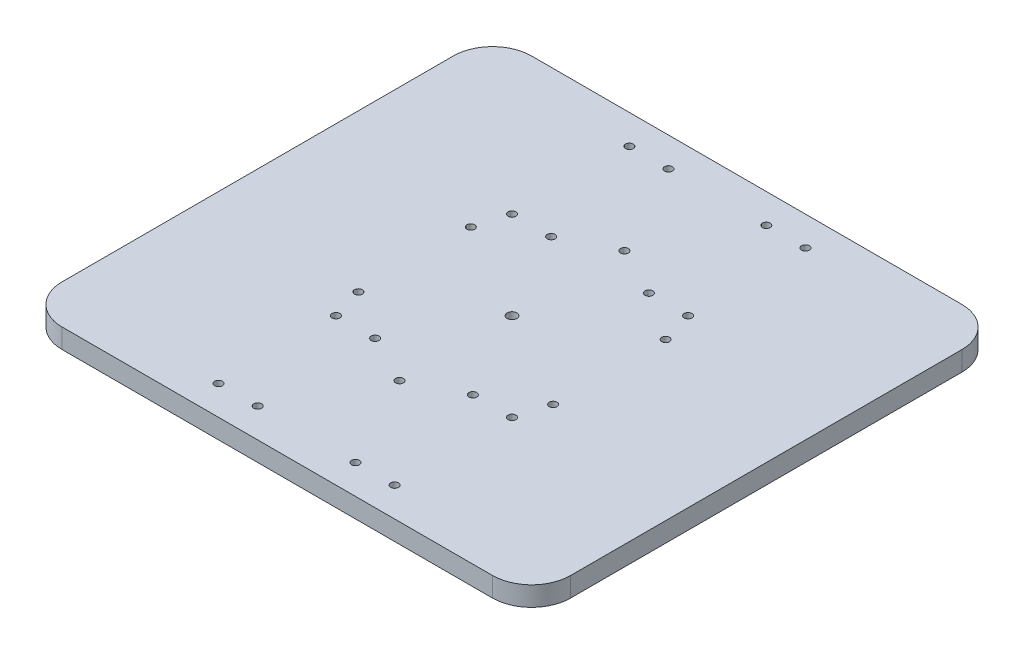
ISO-10303-21;
HEADER;
FILE_DESCRIPTION(('STEP AP214'),'2;1');
FILE_NAME('part.step','',(''),(''),'','','');
FILE_SCHEMA(('AUTOMOTIVE_DESIGN { 1 0 10303 214 1 1 1 1 }'));
ENDSEC;
DATA;
#1=APPLICATION_CONTEXT('core data for automotive mechanical design processes');
#2=APPLICATION_PROTOCOL_DEFINITION('international standard','automotive_design',2000,#1);
#3=PRODUCT_CONTEXT('',#1,'mechanical');
#4=PRODUCT('Part','Part','',(#3));
#5=PRODUCT_RELATED_PRODUCT_CATEGORY('part','',(#4));
#6=PRODUCT_DEFINITION_FORMATION('','',#4);
#7=PRODUCT_DEFINITION_CONTEXT('part definition',#1,'design');
#8=PRODUCT_DEFINITION('design','',#6,#7);
#9=PRODUCT_DEFINITION_SHAPE('','',#8);
#10=(LENGTH_UNIT() NAMED_UNIT(*) SI_UNIT(.MILLI.,.METRE.));
#11=(NAMED_UNIT(*) PLANE_ANGLE_UNIT() SI_UNIT($,.RADIAN.));
#12=(NAMED_UNIT(*) SI_UNIT($,.STERADIAN.) SOLID_ANGLE_UNIT());
#13=UNCERTAINTY_MEASURE_WITH_UNIT(LENGTH_MEASURE(1.E-05),#10,'distance_accuracy_value','');
#14=(GEOMETRIC_REPRESENTATION_CONTEXT(3) GLOBAL_UNCERTAINTY_ASSIGNED_CONTEXT((#13)) GLOBAL_UNIT_ASSIGNED_CONTEXT((#10,
#11,#12)) REPRESENTATION_CONTEXT('',''));
#15=CARTESIAN_POINT('',(0.,0.,0.));
#16=DIRECTION('',(0.,0.,1.));
#17=DIRECTION('',(1.,0.,0.));
#18=AXIS2_PLACEMENT_3D('',#15,#16,#17);
#19=CARTESIAN_POINT('',(130.,10.,120.));
#20=DIRECTION('',(-1.,0.,0.));
#21=DIRECTION('',(0.,0.,1.));
#22=AXIS2_PLACEMENT_3D('',#19,#20,#21);
#23=PLANE('',#22);
#24=DIRECTION('',(0.,0.,-1.));
#25=VECTOR('',#24,1.);
#26=CARTESIAN_POINT('',(130.,0.,120.));
#27=LINE('',#26,#25);
#28=CARTESIAN_POINT('',(130.,0.,100.));
#29=VERTEX_POINT('',#28);
#30=CARTESIAN_POINT('',(130.,0.,-100.));
#31=VERTEX_POINT('',#30);
#32=EDGE_CURVE('E125',#29,#31,#27,.T.);
#33=ORIENTED_EDGE('',*,*,#32,.T.);
#34=DIRECTION('',(0.,-1.,0.));
#35=VECTOR('',#34,1.);
#36=CARTESIAN_POINT('',(130.,10.,-100.));
#37=LINE('',#36,#35);
#38=CARTESIAN_POINT('',(130.,10.,-100.));
#39=VERTEX_POINT('',#38);
#40=EDGE_CURVE('E103',#31,#39,#37,.F.);
#41=ORIENTED_EDGE('',*,*,#40,.T.);
#42=DIRECTION('',(0.,0.,-1.));
#43=VECTOR('',#42,1.);
#44=CARTESIAN_POINT('',(130.,10.,120.));
#45=LINE('',#44,#43);
#46=CARTESIAN_POINT('',(130.,10.,100.));
#47=VERTEX_POINT('',#46);
#48=EDGE_CURVE('E135',#47,#39,#45,.T.);
#49=ORIENTED_EDGE('',*,*,#48,.F.);
#50=DIRECTION('',(0.,-1.,0.));
#51=VECTOR('',#50,1.);
#52=CARTESIAN_POINT('',(130.,10.,100.));
#53=LINE('',#52,#51);
#54=EDGE_CURVE('E108',#47,#29,#53,.T.);
#55=ORIENTED_EDGE('',*,*,#54,.T.);
#56=EDGE_LOOP('',(#33,#41,#49,#55));
#57=FACE_BOUND('',#56,.T.);
#58=ADVANCED_FACE('F32',(#57),#23,.F.);
#59=CARTESIAN_POINT('',(-130.,10.,-120.));
#60=DIRECTION('',(0.,0.,1.));
#61=DIRECTION('',(1.,0.,0.));
#62=AXIS2_PLACEMENT_3D('',#59,#60,#61);
#63=PLANE('',#62);
#64=DIRECTION('',(-1.,0.,0.));
#65=VECTOR('',#64,1.);
#66=CARTESIAN_POINT('',(-130.,10.,-120.));
#67=LINE('',#66,#65);
#68=CARTESIAN_POINT('',(110.,10.,-120.));
#69=VERTEX_POINT('',#68);
#70=CARTESIAN_POINT('',(-110.,10.,-120.));
#71=VERTEX_POINT('',#70);
#72=EDGE_CURVE('E118',#69,#71,#67,.T.);
#73=ORIENTED_EDGE('',*,*,#72,.F.);
#74=DIRECTION('',(0.,-1.,0.));
#75=VECTOR('',#74,1.);
#76=CARTESIAN_POINT('',(110.,10.,-120.));
#77=LINE('',#76,#75);
#78=CARTESIAN_POINT('',(110.,0.,-120.));
#79=VERTEX_POINT('',#78);
#80=EDGE_CURVE('E102',#69,#79,#77,.T.);
#81=ORIENTED_EDGE('',*,*,#80,.T.);
#82=DIRECTION('',(-1.,0.,0.));
#83=VECTOR('',#82,1.);
#84=CARTESIAN_POINT('',(-130.,0.,-120.));
#85=LINE('',#84,#83);
#86=CARTESIAN_POINT('',(-110.,0.,-120.));
#87=VERTEX_POINT('',#86);
#88=EDGE_CURVE('E115',#79,#87,#85,.T.);
#89=ORIENTED_EDGE('',*,*,#88,.T.);
#90=DIRECTION('',(0.,-1.,0.));
#91=VECTOR('',#90,1.);
#92=CARTESIAN_POINT('',(-110.,10.,-120.));
#93=LINE('',#92,#91);
#94=EDGE_CURVE('E120',#87,#71,#93,.F.);
#95=ORIENTED_EDGE('',*,*,#94,.T.);
#96=EDGE_LOOP('',(#73,#81,#89,#95));
#97=FACE_BOUND('',#96,.T.);
#98=ADVANCED_FACE('F114',(#97),#63,.F.);
#99=CARTESIAN_POINT('',(-130.,10.,120.));
#100=DIRECTION('',(1.,0.,0.));
#101=DIRECTION('',(0.,0.,-1.));
#102=AXIS2_PLACEMENT_3D('',#99,#100,#101);
#103=PLANE('',#102);
#104=DIRECTION('',(0.,0.,1.));
#105=VECTOR('',#104,1.);
#106=CARTESIAN_POINT('',(-130.,0.,120.));
#107=LINE('',#106,#105);
#108=CARTESIAN_POINT('',(-130.,0.,-100.));
#109=VERTEX_POINT('',#108);
#110=CARTESIAN_POINT('',(-130.,0.,100.));
#111=VERTEX_POINT('',#110);
#112=EDGE_CURVE('E124',#109,#111,#107,.T.);
#113=ORIENTED_EDGE('',*,*,#112,.T.);
#114=DIRECTION('',(0.,-1.,0.));
#115=VECTOR('',#114,1.);
#116=CARTESIAN_POINT('',(-130.,10.,100.));
#117=LINE('',#116,#115);
#118=CARTESIAN_POINT('',(-130.,10.,100.));
#119=VERTEX_POINT('',#118);
#120=EDGE_CURVE('E11',#111,#119,#117,.F.);
#121=ORIENTED_EDGE('',*,*,#120,.T.);
#122=DIRECTION('',(0.,0.,1.));
#123=VECTOR('',#122,1.);
#124=CARTESIAN_POINT('',(-130.,10.,120.));
#125=LINE('',#124,#123);
#126=CARTESIAN_POINT('',(-130.,10.,-100.));
#127=VERTEX_POINT('',#126);
#128=EDGE_CURVE('E161',#127,#119,#125,.T.);
#129=ORIENTED_EDGE('',*,*,#128,.F.);
#130=DIRECTION('',(0.,-1.,0.));
#131=VECTOR('',#130,1.);
#132=CARTESIAN_POINT('',(-130.,10.,-100.));
#133=LINE('',#132,#131);
#134=EDGE_CURVE('E40',#127,#109,#133,.T.);
#135=ORIENTED_EDGE('',*,*,#134,.T.);
#136=EDGE_LOOP('',(#113,#121,#129,#135));
#137=FACE_BOUND('',#136,.T.);
#138=ADVANCED_FACE('F159',(#137),#103,.F.);
#139=CARTESIAN_POINT('',(-130.,10.,120.));
#140=DIRECTION('',(0.,0.,-1.));
#141=DIRECTION('',(-1.,0.,0.));
#142=AXIS2_PLACEMENT_3D('',#139,#140,#141);
#143=PLANE('',#142);
#144=DIRECTION('',(1.,0.,0.));
#145=VECTOR('',#144,1.);
#146=CARTESIAN_POINT('',(-130.,0.,120.));
#147=LINE('',#146,#145);
#148=CARTESIAN_POINT('',(-110.,0.,120.));
#149=VERTEX_POINT('',#148);
#150=CARTESIAN_POINT('',(110.,0.,120.));
#151=VERTEX_POINT('',#150);
#152=EDGE_CURVE('E128',#149,#151,#147,.T.);
#153=ORIENTED_EDGE('',*,*,#152,.T.);
#154=DIRECTION('',(0.,-1.,0.));
#155=VECTOR('',#154,1.);
#156=CARTESIAN_POINT('',(110.,10.,120.));
#157=LINE('',#156,#155);
#158=CARTESIAN_POINT('',(110.,10.,120.));
#159=VERTEX_POINT('',#158);
#160=EDGE_CURVE('E47',#151,#159,#157,.F.);
#161=ORIENTED_EDGE('',*,*,#160,.T.);
#162=DIRECTION('',(1.,0.,0.));
#163=VECTOR('',#162,1.);
#164=CARTESIAN_POINT('',(-130.,10.,120.));
#165=LINE('',#164,#163);
#166=CARTESIAN_POINT('',(-110.,10.,120.));
#167=VERTEX_POINT('',#166);
#168=EDGE_CURVE('E136',#167,#159,#165,.T.);
#169=ORIENTED_EDGE('',*,*,#168,.F.);
#170=DIRECTION('',(0.,-1.,0.));
#171=VECTOR('',#170,1.);
#172=CARTESIAN_POINT('',(-110.,10.,120.));
#173=LINE('',#172,#171);
#174=EDGE_CURVE('E152',#167,#149,#173,.T.);
#175=ORIENTED_EDGE('',*,*,#174,.T.);
#176=EDGE_LOOP('',(#153,#161,#169,#175));
#177=FACE_BOUND('',#176,.T.);
#178=ADVANCED_FACE('F168',(#177),#143,.F.);
#179=CARTESIAN_POINT('',(0.,10.,0.));
#180=DIRECTION('',(0.,-1.,0.));
#181=DIRECTION('',(0.,0.,-1.));
#182=AXIS2_PLACEMENT_3D('',#179,#180,#181);
#183=PLANE('',#182);
#184=CARTESIAN_POINT('',(-25.,10.,45.));
#185=DIRECTION('',(0.,1.,0.));
#186=DIRECTION('',(0.,0.,1.));
#187=AXIS2_PLACEMENT_3D('',#184,#185,#186);
#188=CIRCLE('',#187,2.);
#189=CARTESIAN_POINT('',(-25.,10.,47.));
#190=VERTEX_POINT('',#189);
#191=EDGE_CURVE('E259',#190,#190,#188,.T.);
#192=ORIENTED_EDGE('',*,*,#191,.F.);
#193=EDGE_LOOP('',(#192));
#194=FACE_BOUND('',#193,.T.);
#195=CARTESIAN_POINT('',(-45.,10.,45.));
#196=DIRECTION('',(0.,1.,0.));
#197=DIRECTION('',(0.,0.,1.));
#198=AXIS2_PLACEMENT_3D('',#195,#196,#197);
#199=CIRCLE('',#198,2.);
#200=CARTESIAN_POINT('',(-45.,10.,47.));
#201=VERTEX_POINT('',#200);
#202=EDGE_CURVE('E272',#201,#201,#199,.T.);
#203=ORIENTED_EDGE('',*,*,#202,.F.);
#204=EDGE_LOOP('',(#203));
#205=FACE_BOUND('',#204,.T.);
#206=CARTESIAN_POINT('',(25.,10.,-45.));
#207=DIRECTION('',(0.,1.,0.));
#208=DIRECTION('',(0.,0.,1.));
#209=AXIS2_PLACEMENT_3D('',#206,#207,#208);
#210=CIRCLE('',#209,2.00000000000001);
#211=CARTESIAN_POINT('',(25.,10.,-43.));
#212=VERTEX_POINT('',#211);
#213=EDGE_CURVE('E265',#212,#212,#210,.T.);
#214=ORIENTED_EDGE('',*,*,#213,.F.);
#215=EDGE_LOOP('',(#214));
#216=FACE_BOUND('',#215,.T.);
#217=CARTESIAN_POINT('',(25.,10.,45.));
#218=DIRECTION('',(0.,1.,0.));
#219=DIRECTION('',(0.,0.,1.));
#220=AXIS2_PLACEMENT_3D('',#217,#218,#219);
#221=CIRCLE('',#220,2.00000000000001);
#222=CARTESIAN_POINT('',(25.,10.,47.));
#223=VERTEX_POINT('',#222);
#224=EDGE_CURVE('E247',#223,#223,#221,.T.);
#225=ORIENTED_EDGE('',*,*,#224,.F.);
#226=EDGE_LOOP('',(#225));
#227=FACE_BOUND('',#226,.T.);
#228=CARTESIAN_POINT('',(45.,10.,45.));
#229=DIRECTION('',(0.,1.,0.));
#230=DIRECTION('',(0.,0.,1.));
#231=AXIS2_PLACEMENT_3D('',#228,#229,#230);
#232=CIRCLE('',#231,2.);
#233=CARTESIAN_POINT('',(45.,10.,47.));
#234=VERTEX_POINT('',#233);
#235=EDGE_CURVE('E254',#234,#234,#232,.T.);
#236=ORIENTED_EDGE('',*,*,#235,.F.);
#237=EDGE_LOOP('',(#236));
#238=FACE_BOUND('',#237,.T.);
#239=CARTESIAN_POINT('',(-25.,10.,105.));
#240=DIRECTION('',(0.,1.,0.));
#241=DIRECTION('',(0.,0.,1.));
#242=AXIS2_PLACEMENT_3D('',#239,#240,#241);
#243=CIRCLE('',#242,2.00000000000001);
#244=CARTESIAN_POINT('',(-25.,10.,107.));
#245=VERTEX_POINT('',#244);
#246=EDGE_CURVE('E295',#245,#245,#243,.T.);
#247=ORIENTED_EDGE('',*,*,#246,.F.);
#248=EDGE_LOOP('',(#247));
#249=FACE_BOUND('',#248,.T.);
#250=CARTESIAN_POINT('',(25.,10.,105.));
#251=DIRECTION('',(0.,1.,0.));
#252=DIRECTION('',(0.,0.,1.));
#253=AXIS2_PLACEMENT_3D('',#250,#251,#252);
#254=CIRCLE('',#253,2.);
#255=CARTESIAN_POINT('',(25.,10.,107.));
#256=VERTEX_POINT('',#255);
#257=EDGE_CURVE('E307',#256,#256,#254,.T.);
#258=ORIENTED_EDGE('',*,*,#257,.F.);
#259=EDGE_LOOP('',(#258));
#260=FACE_BOUND('',#259,.T.);
#261=CARTESIAN_POINT('',(-49.796460717604,10.,-28.7499999999978));
#262=DIRECTION('',(0.,1.,0.));
#263=DIRECTION('',(0.,0.,1.));
#264=AXIS2_PLACEMENT_3D('',#261,#262,#263);
#265=CIRCLE('',#264,2.00000000000247);
#266=CARTESIAN_POINT('',(-49.796460717604,10.,-26.7499999999954));
#267=VERTEX_POINT('',#266);
#268=EDGE_CURVE('E301',#267,#267,#265,.T.);
#269=ORIENTED_EDGE('',*,*,#268,.F.);
#270=EDGE_LOOP('',(#269));
#271=FACE_BOUND('',#270,.T.);
#272=CARTESIAN_POINT('',(-45.,10.,105.));
#273=DIRECTION('',(0.,1.,0.));
#274=DIRECTION('',(0.,0.,1.));
#275=AXIS2_PLACEMENT_3D('',#272,#273,#274);
#276=CIRCLE('',#275,2.);
#277=CARTESIAN_POINT('',(-45.,10.,107.));
#278=VERTEX_POINT('',#277);
#279=EDGE_CURVE('E277',#278,#278,#276,.T.);
#280=ORIENTED_EDGE('',*,*,#279,.F.);
#281=EDGE_LOOP('',(#280));
#282=FACE_BOUND('',#281,.T.);
#283=CARTESIAN_POINT('',(-49.7964607176015,10.,28.7500000000021));
#284=DIRECTION('',(0.,1.,0.));
#285=DIRECTION('',(0.,0.,1.));
#286=AXIS2_PLACEMENT_3D('',#283,#284,#285);
#287=CIRCLE('',#286,2.00000000000465);
#288=CARTESIAN_POINT('',(-49.7964607176015,10.,30.7500000000068));
#289=VERTEX_POINT('',#288);
#290=EDGE_CURVE('E284',#289,#289,#287,.T.);
#291=ORIENTED_EDGE('',*,*,#290,.F.);
#292=EDGE_LOOP('',(#291));
#293=FACE_BOUND('',#292,.T.);
#294=CARTESIAN_POINT('',(-25.,10.,-45.));
#295=DIRECTION('',(0.,1.,0.));
#296=DIRECTION('',(0.,0.,1.));
#297=AXIS2_PLACEMENT_3D('',#294,#295,#296);
#298=CIRCLE('',#297,2.);
#299=CARTESIAN_POINT('',(-25.,10.,-43.));
#300=VERTEX_POINT('',#299);
#301=EDGE_CURVE('E290',#300,#300,#298,.T.);
#302=ORIENTED_EDGE('',*,*,#301,.F.);
#303=EDGE_LOOP('',(#302));
#304=FACE_BOUND('',#303,.T.);
#305=CARTESIAN_POINT('',(-45.,10.,-105.));
#306=DIRECTION('',(0.,1.,0.));
#307=DIRECTION('',(0.,0.,1.));
#308=AXIS2_PLACEMENT_3D('',#305,#306,#307);
#309=CIRCLE('',#308,2.);
#310=CARTESIAN_POINT('',(-45.,10.,-103.));
#311=VERTEX_POINT('',#310);
#312=EDGE_CURVE('E193',#311,#311,#309,.T.);
#313=ORIENTED_EDGE('',*,*,#312,.F.);
#314=EDGE_LOOP('',(#313));
#315=FACE_BOUND('',#314,.T.);
#316=CARTESIAN_POINT('',(45.,10.,-105.));
#317=DIRECTION('',(0.,1.,0.));
#318=DIRECTION('',(0.,0.,1.));
#319=AXIS2_PLACEMENT_3D('',#316,#317,#318);
#320=CIRCLE('',#319,2.);
#321=CARTESIAN_POINT('',(45.,10.,-103.));
#322=VERTEX_POINT('',#321);
#323=EDGE_CURVE('E200',#322,#322,#320,.T.);
#324=ORIENTED_EDGE('',*,*,#323,.F.);
#325=EDGE_LOOP('',(#324));
#326=FACE_BOUND('',#325,.T.);
#327=CARTESIAN_POINT('',(-45.,10.,-45.));
#328=DIRECTION('',(0.,1.,0.));
#329=DIRECTION('',(0.,0.,1.));
#330=AXIS2_PLACEMENT_3D('',#327,#328,#329);
#331=CIRCLE('',#330,2.);
#332=CARTESIAN_POINT('',(-45.,10.,-43.));
#333=VERTEX_POINT('',#332);
#334=EDGE_CURVE('E206',#333,#333,#331,.T.);
#335=ORIENTED_EDGE('',*,*,#334,.F.);
#336=EDGE_LOOP('',(#335));
#337=FACE_BOUND('',#336,.T.);
#338=CARTESIAN_POINT('',(45.,10.,-45.));
#339=DIRECTION('',(0.,1.,0.));
#340=DIRECTION('',(0.,0.,1.));
#341=AXIS2_PLACEMENT_3D('',#338,#339,#340);
#342=CIRCLE('',#341,2.);
#343=CARTESIAN_POINT('',(45.,10.,-43.));
#344=VERTEX_POINT('',#343);
#345=EDGE_CURVE('E181',#344,#344,#342,.T.);
#346=ORIENTED_EDGE('',*,*,#345,.F.);
#347=EDGE_LOOP('',(#346));
#348=FACE_BOUND('',#347,.T.);
#349=CARTESIAN_POINT('',(0.,10.,-57.5));
#350=DIRECTION('',(0.,1.,0.));
#351=DIRECTION('',(0.,0.,1.));
#352=AXIS2_PLACEMENT_3D('',#349,#350,#351);
#353=CIRCLE('',#352,2.);
#354=CARTESIAN_POINT('',(0.,10.,-55.5));
#355=VERTEX_POINT('',#354);
#356=EDGE_CURVE('E188',#355,#355,#353,.T.);
#357=ORIENTED_EDGE('',*,*,#356,.F.);
#358=EDGE_LOOP('',(#357));
#359=FACE_BOUND('',#358,.T.);
#360=CARTESIAN_POINT('',(25.,10.,-105.));
#361=DIRECTION('',(0.,1.,0.));
#362=DIRECTION('',(0.,0.,1.));
#363=AXIS2_PLACEMENT_3D('',#360,#361,#362);
#364=CIRCLE('',#363,2.);
#365=CARTESIAN_POINT('',(25.,10.,-103.));
#366=VERTEX_POINT('',#365);
#367=EDGE_CURVE('E242',#366,#366,#364,.T.);
#368=ORIENTED_EDGE('',*,*,#367,.F.);
#369=EDGE_LOOP('',(#368));
#370=FACE_BOUND('',#369,.T.);
#371=CARTESIAN_POINT('',(-25.,10.,-105.));
#372=DIRECTION('',(0.,1.,0.));
#373=DIRECTION('',(0.,0.,1.));
#374=AXIS2_PLACEMENT_3D('',#371,#372,#373);
#375=CIRCLE('',#374,2.00000000000001);
#376=CARTESIAN_POINT('',(-25.,10.,-103.));
#377=VERTEX_POINT('',#376);
#378=EDGE_CURVE('E236',#377,#377,#375,.T.);
#379=ORIENTED_EDGE('',*,*,#378,.F.);
#380=EDGE_LOOP('',(#379));
#381=FACE_BOUND('',#380,.T.);
#382=CARTESIAN_POINT('',(4.8886614385545E-12,10.,57.5));
#383=DIRECTION('',(0.,1.,0.));
#384=DIRECTION('',(0.,0.,1.));
#385=AXIS2_PLACEMENT_3D('',#382,#383,#384);
#386=CIRCLE('',#385,2.00000000000506);
#387=CARTESIAN_POINT('',(4.8886614385545E-12,10.,59.5000000000051));
#388=VERTEX_POINT('',#387);
#389=EDGE_CURVE('E218',#388,#388,#386,.T.);
#390=ORIENTED_EDGE('',*,*,#389,.F.);
#391=EDGE_LOOP('',(#390));
#392=FACE_BOUND('',#391,.T.);
#393=CARTESIAN_POINT('',(45.,10.,105.));
#394=DIRECTION('',(0.,1.,0.));
#395=DIRECTION('',(0.,0.,1.));
#396=AXIS2_PLACEMENT_3D('',#393,#394,#395);
#397=CIRCLE('',#396,2.);
#398=CARTESIAN_POINT('',(45.,10.,107.));
#399=VERTEX_POINT('',#398);
#400=EDGE_CURVE('E219',#399,#399,#397,.T.);
#401=ORIENTED_EDGE('',*,*,#400,.F.);
#402=EDGE_LOOP('',(#401));
#403=FACE_BOUND('',#402,.T.);
#404=CARTESIAN_POINT('',(49.7964607176064,10.,-28.7500000000021));
#405=DIRECTION('',(0.,1.,0.));
#406=DIRECTION('',(0.,0.,1.));
#407=AXIS2_PLACEMENT_3D('',#404,#405,#406);
#408=CIRCLE('',#407,2.00000000000069);
#409=CARTESIAN_POINT('',(49.7964607176064,10.,-26.7500000000014));
#410=VERTEX_POINT('',#409);
#411=EDGE_CURVE('E226',#410,#410,#408,.T.);
#412=ORIENTED_EDGE('',*,*,#411,.F.);
#413=EDGE_LOOP('',(#412));
#414=FACE_BOUND('',#413,.T.);
#415=CARTESIAN_POINT('',(49.7964607176089,10.,28.7499999999979));
#416=DIRECTION('',(0.,1.,0.));
#417=DIRECTION('',(0.,0.,1.));
#418=AXIS2_PLACEMENT_3D('',#415,#416,#417);
#419=CIRCLE('',#418,2.00000000000315);
#420=CARTESIAN_POINT('',(49.7964607176089,10.,30.750000000001));
#421=VERTEX_POINT('',#420);
#422=EDGE_CURVE('E211',#421,#421,#419,.T.);
#423=ORIENTED_EDGE('',*,*,#422,.F.);
#424=EDGE_LOOP('',(#423));
#425=FACE_BOUND('',#424,.T.);
#426=CARTESIAN_POINT('',(0.,10.,0.));
#427=DIRECTION('',(0.,1.,0.));
#428=DIRECTION('',(0.,0.,1.));
#429=AXIS2_PLACEMENT_3D('',#426,#427,#428);
#430=CIRCLE('',#429,2.5);
#431=CARTESIAN_POINT('',(0.,10.,2.5));
#432=VERTEX_POINT('',#431);
#433=EDGE_CURVE('E175',#432,#432,#430,.T.);
#434=ORIENTED_EDGE('',*,*,#433,.F.);
#435=EDGE_LOOP('',(#434));
#436=FACE_BOUND('',#435,.T.);
#437=ORIENTED_EDGE('',*,*,#48,.T.);
#438=CARTESIAN_POINT('',(110.,10.,-100.));
#439=DIRECTION('',(0.,-1.,0.));
#440=DIRECTION('',(0.,0.,-1.));
#441=AXIS2_PLACEMENT_3D('',#438,#439,#440);
#442=CIRCLE('',#441,20.);
#443=EDGE_CURVE('E150',#39,#69,#442,.F.);
#444=ORIENTED_EDGE('',*,*,#443,.T.);
#445=ORIENTED_EDGE('',*,*,#72,.T.);
#446=CARTESIAN_POINT('',(-110.,10.,-100.));
#447=DIRECTION('',(0.,-1.,0.));
#448=DIRECTION('',(0.,0.,-1.));
#449=AXIS2_PLACEMENT_3D('',#446,#447,#448);
#450=CIRCLE('',#449,20.);
#451=EDGE_CURVE('E145',#71,#127,#450,.F.);
#452=ORIENTED_EDGE('',*,*,#451,.T.);
#453=ORIENTED_EDGE('',*,*,#128,.T.);
#454=CARTESIAN_POINT('',(-110.,10.,100.));
#455=DIRECTION('',(0.,-1.,0.));
#456=DIRECTION('',(0.,0.,-1.));
#457=AXIS2_PLACEMENT_3D('',#454,#455,#456);
#458=CIRCLE('',#457,20.);
#459=EDGE_CURVE('E54',#119,#167,#458,.F.);
#460=ORIENTED_EDGE('',*,*,#459,.T.);
#461=ORIENTED_EDGE('',*,*,#168,.T.);
#462=CARTESIAN_POINT('',(110.,10.,100.));
#463=DIRECTION('',(0.,-1.,0.));
#464=DIRECTION('',(0.,0.,-1.));
#465=AXIS2_PLACEMENT_3D('',#462,#463,#464);
#466=CIRCLE('',#465,20.);
#467=EDGE_CURVE('E148',#159,#47,#466,.F.);
#468=ORIENTED_EDGE('',*,*,#467,.T.);
#469=EDGE_LOOP('',(#437,#444,#445,#452,#453,#460,#461,#468));
#470=FACE_BOUND('',#469,.T.);
#471=ADVANCED_FACE('F323',(#194,#205,#216,#227,#238,#249,#260,#271,#282,#293,#304,#315,#326,
#337,#348,#359,#370,#381,#392,#403,#414,#425,#436,#470),#183,.F.);
#472=CARTESIAN_POINT('',(0.,0.,0.));
#473=DIRECTION('',(0.,-1.,0.));
#474=DIRECTION('',(0.,0.,-1.));
#475=AXIS2_PLACEMENT_3D('',#472,#473,#474);
#476=PLANE('',#475);
#477=CARTESIAN_POINT('',(-25.,0.,45.));
#478=DIRECTION('',(0.,1.,0.));
#479=DIRECTION('',(0.,0.,1.));
#480=AXIS2_PLACEMENT_3D('',#477,#478,#479);
#481=CIRCLE('',#480,2.);
#482=CARTESIAN_POINT('',(-25.,0.,47.));
#483=VERTEX_POINT('',#482);
#484=EDGE_CURVE('E251',#483,#483,#481,.T.);
#485=ORIENTED_EDGE('',*,*,#484,.T.);
#486=EDGE_LOOP('',(#485));
#487=FACE_BOUND('',#486,.T.);
#488=CARTESIAN_POINT('',(-45.,0.,45.));
#489=DIRECTION('',(0.,1.,0.));
#490=DIRECTION('',(0.,0.,1.));
#491=AXIS2_PLACEMENT_3D('',#488,#489,#490);
#492=CIRCLE('',#491,2.);
#493=CARTESIAN_POINT('',(-45.,0.,47.));
#494=VERTEX_POINT('',#493);
#495=EDGE_CURVE('E262',#494,#494,#492,.T.);
#496=ORIENTED_EDGE('',*,*,#495,.T.);
#497=EDGE_LOOP('',(#496));
#498=FACE_BOUND('',#497,.T.);
#499=CARTESIAN_POINT('',(25.,0.,-45.));
#500=DIRECTION('',(0.,1.,0.));
#501=DIRECTION('',(0.,0.,1.));
#502=AXIS2_PLACEMENT_3D('',#499,#500,#501);
#503=CIRCLE('',#502,2.00000000000001);
#504=CARTESIAN_POINT('',(25.,0.,-43.));
#505=VERTEX_POINT('',#504);
#506=EDGE_CURVE('E268',#505,#505,#503,.T.);
#507=ORIENTED_EDGE('',*,*,#506,.T.);
#508=EDGE_LOOP('',(#507));
#509=FACE_BOUND('',#508,.T.);
#510=CARTESIAN_POINT('',(25.,0.,45.));
#511=DIRECTION('',(0.,1.,0.));
#512=DIRECTION('',(0.,0.,1.));
#513=AXIS2_PLACEMENT_3D('',#510,#511,#512);
#514=CIRCLE('',#513,2.00000000000001);
#515=CARTESIAN_POINT('',(25.,0.,47.));
#516=VERTEX_POINT('',#515);
#517=EDGE_CURVE('E250',#516,#516,#514,.T.);
#518=ORIENTED_EDGE('',*,*,#517,.T.);
#519=EDGE_LOOP('',(#518));
#520=FACE_BOUND('',#519,.T.);
#521=CARTESIAN_POINT('',(45.,0.,45.));
#522=DIRECTION('',(0.,1.,0.));
#523=DIRECTION('',(0.,0.,1.));
#524=AXIS2_PLACEMENT_3D('',#521,#522,#523);
#525=CIRCLE('',#524,2.);
#526=CARTESIAN_POINT('',(45.,0.,47.));
#527=VERTEX_POINT('',#526);
#528=EDGE_CURVE('E223',#527,#527,#525,.T.);
#529=ORIENTED_EDGE('',*,*,#528,.T.);
#530=EDGE_LOOP('',(#529));
#531=FACE_BOUND('',#530,.T.);
#532=CARTESIAN_POINT('',(-25.,0.,105.));
#533=DIRECTION('',(0.,1.,0.));
#534=DIRECTION('',(0.,0.,1.));
#535=AXIS2_PLACEMENT_3D('',#532,#533,#534);
#536=CIRCLE('',#535,2.00000000000001);
#537=CARTESIAN_POINT('',(-25.,0.,107.));
#538=VERTEX_POINT('',#537);
#539=EDGE_CURVE('E281',#538,#538,#536,.T.);
#540=ORIENTED_EDGE('',*,*,#539,.T.);
#541=EDGE_LOOP('',(#540));
#542=FACE_BOUND('',#541,.T.);
#543=CARTESIAN_POINT('',(25.,0.,105.));
#544=DIRECTION('',(0.,1.,0.));
#545=DIRECTION('',(0.,0.,1.));
#546=AXIS2_PLACEMENT_3D('',#543,#544,#545);
#547=CIRCLE('',#546,2.);
#548=CARTESIAN_POINT('',(25.,0.,107.));
#549=VERTEX_POINT('',#548);
#550=EDGE_CURVE('E298',#549,#549,#547,.T.);
#551=ORIENTED_EDGE('',*,*,#550,.T.);
#552=EDGE_LOOP('',(#551));
#553=FACE_BOUND('',#552,.T.);
#554=CARTESIAN_POINT('',(-49.796460717604,0.,-28.7499999999978));
#555=DIRECTION('',(0.,1.,0.));
#556=DIRECTION('',(0.,0.,1.));
#557=AXIS2_PLACEMENT_3D('',#554,#555,#556);
#558=CIRCLE('',#557,2.00000000000247);
#559=CARTESIAN_POINT('',(-49.796460717604,0.,-26.7499999999954));
#560=VERTEX_POINT('',#559);
#561=EDGE_CURVE('E304',#560,#560,#558,.T.);
#562=ORIENTED_EDGE('',*,*,#561,.T.);
#563=EDGE_LOOP('',(#562));
#564=FACE_BOUND('',#563,.T.);
#565=CARTESIAN_POINT('',(-45.,0.,105.));
#566=DIRECTION('',(0.,1.,0.));
#567=DIRECTION('',(0.,0.,1.));
#568=AXIS2_PLACEMENT_3D('',#565,#566,#567);
#569=CIRCLE('',#568,2.);
#570=CARTESIAN_POINT('',(-45.,0.,107.));
#571=VERTEX_POINT('',#570);
#572=EDGE_CURVE('E280',#571,#571,#569,.T.);
#573=ORIENTED_EDGE('',*,*,#572,.T.);
#574=EDGE_LOOP('',(#573));
#575=FACE_BOUND('',#574,.T.);
#576=CARTESIAN_POINT('',(-49.7964607176015,0.,28.7500000000021));
#577=DIRECTION('',(0.,1.,0.));
#578=DIRECTION('',(0.,0.,1.));
#579=AXIS2_PLACEMENT_3D('',#576,#577,#578);
#580=CIRCLE('',#579,2.00000000000465);
#581=CARTESIAN_POINT('',(-49.7964607176015,0.,30.7500000000068));
#582=VERTEX_POINT('',#581);
#583=EDGE_CURVE('E287',#582,#582,#580,.T.);
#584=ORIENTED_EDGE('',*,*,#583,.T.);
#585=EDGE_LOOP('',(#584));
#586=FACE_BOUND('',#585,.T.);
#587=CARTESIAN_POINT('',(-25.,0.,-45.));
#588=DIRECTION('',(0.,1.,0.));
#589=DIRECTION('',(0.,0.,1.));
#590=AXIS2_PLACEMENT_3D('',#587,#588,#589);
#591=CIRCLE('',#590,2.);
#592=CARTESIAN_POINT('',(-25.,0.,-43.));
#593=VERTEX_POINT('',#592);
#594=EDGE_CURVE('E269',#593,#593,#591,.T.);
#595=ORIENTED_EDGE('',*,*,#594,.T.);
#596=EDGE_LOOP('',(#595));
#597=FACE_BOUND('',#596,.T.);
#598=CARTESIAN_POINT('',(-45.,0.,-105.));
#599=DIRECTION('',(0.,1.,0.));
#600=DIRECTION('',(0.,0.,1.));
#601=AXIS2_PLACEMENT_3D('',#598,#599,#600);
#602=CIRCLE('',#601,2.);
#603=CARTESIAN_POINT('',(-45.,0.,-103.));
#604=VERTEX_POINT('',#603);
#605=EDGE_CURVE('E196',#604,#604,#602,.T.);
#606=ORIENTED_EDGE('',*,*,#605,.T.);
#607=EDGE_LOOP('',(#606));
#608=FACE_BOUND('',#607,.T.);
#609=CARTESIAN_POINT('',(45.,0.,-105.));
#610=DIRECTION('',(0.,1.,0.));
#611=DIRECTION('',(0.,0.,1.));
#612=AXIS2_PLACEMENT_3D('',#609,#610,#611);
#613=CIRCLE('',#612,2.);
#614=CARTESIAN_POINT('',(45.,0.,-103.));
#615=VERTEX_POINT('',#614);
#616=EDGE_CURVE('E203',#615,#615,#613,.T.);
#617=ORIENTED_EDGE('',*,*,#616,.T.);
#618=EDGE_LOOP('',(#617));
#619=FACE_BOUND('',#618,.T.);
#620=CARTESIAN_POINT('',(-45.,0.,-45.));
#621=DIRECTION('',(0.,1.,0.));
#622=DIRECTION('',(0.,0.,1.));
#623=AXIS2_PLACEMENT_3D('',#620,#621,#622);
#624=CIRCLE('',#623,2.);
#625=CARTESIAN_POINT('',(-45.,0.,-43.));
#626=VERTEX_POINT('',#625);
#627=EDGE_CURVE('E185',#626,#626,#624,.T.);
#628=ORIENTED_EDGE('',*,*,#627,.T.);
#629=EDGE_LOOP('',(#628));
#630=FACE_BOUND('',#629,.T.);
#631=CARTESIAN_POINT('',(45.,0.,-45.));
#632=DIRECTION('',(0.,1.,0.));
#633=DIRECTION('',(0.,0.,1.));
#634=AXIS2_PLACEMENT_3D('',#631,#632,#633);
#635=CIRCLE('',#634,2.);
#636=CARTESIAN_POINT('',(45.,0.,-43.));
#637=VERTEX_POINT('',#636);
#638=EDGE_CURVE('E184',#637,#637,#635,.T.);
#639=ORIENTED_EDGE('',*,*,#638,.T.);
#640=EDGE_LOOP('',(#639));
#641=FACE_BOUND('',#640,.T.);
#642=CARTESIAN_POINT('',(0.,0.,-57.5));
#643=DIRECTION('',(0.,1.,0.));
#644=DIRECTION('',(0.,0.,1.));
#645=AXIS2_PLACEMENT_3D('',#642,#643,#644);
#646=CIRCLE('',#645,2.);
#647=CARTESIAN_POINT('',(0.,0.,-55.5));
#648=VERTEX_POINT('',#647);
#649=EDGE_CURVE('E178',#648,#648,#646,.T.);
#650=ORIENTED_EDGE('',*,*,#649,.T.);
#651=EDGE_LOOP('',(#650));
#652=FACE_BOUND('',#651,.T.);
#653=CARTESIAN_POINT('',(25.,0.,-105.));
#654=DIRECTION('',(0.,1.,0.));
#655=DIRECTION('',(0.,0.,1.));
#656=AXIS2_PLACEMENT_3D('',#653,#654,#655);
#657=CIRCLE('',#656,2.);
#658=CARTESIAN_POINT('',(25.,0.,-103.));
#659=VERTEX_POINT('',#658);
#660=EDGE_CURVE('E197',#659,#659,#657,.T.);
#661=ORIENTED_EDGE('',*,*,#660,.T.);
#662=EDGE_LOOP('',(#661));
#663=FACE_BOUND('',#662,.T.);
#664=CARTESIAN_POINT('',(-25.,0.,-105.));
#665=DIRECTION('',(0.,1.,0.));
#666=DIRECTION('',(0.,0.,1.));
#667=AXIS2_PLACEMENT_3D('',#664,#665,#666);
#668=CIRCLE('',#667,2.00000000000001);
#669=CARTESIAN_POINT('',(-25.,0.,-103.));
#670=VERTEX_POINT('',#669);
#671=EDGE_CURVE('E239',#670,#670,#668,.T.);
#672=ORIENTED_EDGE('',*,*,#671,.T.);
#673=EDGE_LOOP('',(#672));
#674=FACE_BOUND('',#673,.T.);
#675=CARTESIAN_POINT('',(4.8886614385545E-12,0.,57.5));
#676=DIRECTION('',(0.,1.,0.));
#677=DIRECTION('',(0.,0.,1.));
#678=AXIS2_PLACEMENT_3D('',#675,#676,#677);
#679=CIRCLE('',#678,2.00000000000506);
#680=CARTESIAN_POINT('',(4.8886614385545E-12,0.,59.5000000000051));
#681=VERTEX_POINT('',#680);
#682=EDGE_CURVE('E233',#681,#681,#679,.T.);
#683=ORIENTED_EDGE('',*,*,#682,.T.);
#684=EDGE_LOOP('',(#683));
#685=FACE_BOUND('',#684,.T.);
#686=CARTESIAN_POINT('',(45.,0.,105.));
#687=DIRECTION('',(0.,1.,0.));
#688=DIRECTION('',(0.,0.,1.));
#689=AXIS2_PLACEMENT_3D('',#686,#687,#688);
#690=CIRCLE('',#689,2.);
#691=CARTESIAN_POINT('',(45.,0.,107.));
#692=VERTEX_POINT('',#691);
#693=EDGE_CURVE('E222',#692,#692,#690,.T.);
#694=ORIENTED_EDGE('',*,*,#693,.T.);
#695=EDGE_LOOP('',(#694));
#696=FACE_BOUND('',#695,.T.);
#697=CARTESIAN_POINT('',(49.7964607176064,0.,-28.7500000000021));
#698=DIRECTION('',(0.,1.,0.));
#699=DIRECTION('',(0.,0.,1.));
#700=AXIS2_PLACEMENT_3D('',#697,#698,#699);
#701=CIRCLE('',#700,2.00000000000069);
#702=CARTESIAN_POINT('',(49.7964607176064,0.,-26.7500000000014));
#703=VERTEX_POINT('',#702);
#704=EDGE_CURVE('E215',#703,#703,#701,.T.);
#705=ORIENTED_EDGE('',*,*,#704,.T.);
#706=EDGE_LOOP('',(#705));
#707=FACE_BOUND('',#706,.T.);
#708=CARTESIAN_POINT('',(49.7964607176089,0.,28.7499999999979));
#709=DIRECTION('',(0.,1.,0.));
#710=DIRECTION('',(0.,0.,1.));
#711=AXIS2_PLACEMENT_3D('',#708,#709,#710);
#712=CIRCLE('',#711,2.00000000000315);
#713=CARTESIAN_POINT('',(49.7964607176089,0.,30.750000000001));
#714=VERTEX_POINT('',#713);
#715=EDGE_CURVE('E214',#714,#714,#712,.T.);
#716=ORIENTED_EDGE('',*,*,#715,.T.);
#717=EDGE_LOOP('',(#716));
#718=FACE_BOUND('',#717,.T.);
#719=CARTESIAN_POINT('',(0.,0.,0.));
#720=DIRECTION('',(0.,1.,0.));
#721=DIRECTION('',(0.,0.,1.));
#722=AXIS2_PLACEMENT_3D('',#719,#720,#721);
#723=CIRCLE('',#722,2.5);
#724=CARTESIAN_POINT('',(0.,0.,2.5));
#725=VERTEX_POINT('',#724);
#726=EDGE_CURVE('E130',#725,#725,#723,.T.);
#727=ORIENTED_EDGE('',*,*,#726,.T.);
#728=EDGE_LOOP('',(#727));
#729=FACE_BOUND('',#728,.T.);
#730=ORIENTED_EDGE('',*,*,#88,.F.);
#731=CARTESIAN_POINT('',(110.,0.,-100.));
#732=DIRECTION('',(0.,-1.,0.));
#733=DIRECTION('',(0.,0.,-1.));
#734=AXIS2_PLACEMENT_3D('',#731,#732,#733);
#735=CIRCLE('',#734,20.);
#736=EDGE_CURVE('E98',#79,#31,#735,.T.);
#737=ORIENTED_EDGE('',*,*,#736,.T.);
#738=ORIENTED_EDGE('',*,*,#32,.F.);
#739=CARTESIAN_POINT('',(110.,0.,100.));
#740=DIRECTION('',(0.,-1.,0.));
#741=DIRECTION('',(0.,0.,-1.));
#742=AXIS2_PLACEMENT_3D('',#739,#740,#741);
#743=CIRCLE('',#742,20.);
#744=EDGE_CURVE('E109',#29,#151,#743,.T.);
#745=ORIENTED_EDGE('',*,*,#744,.T.);
#746=ORIENTED_EDGE('',*,*,#152,.F.);
#747=CARTESIAN_POINT('',(-110.,0.,100.));
#748=DIRECTION('',(0.,-1.,0.));
#749=DIRECTION('',(0.,0.,-1.));
#750=AXIS2_PLACEMENT_3D('',#747,#748,#749);
#751=CIRCLE('',#750,20.);
#752=EDGE_CURVE('E139',#149,#111,#751,.T.);
#753=ORIENTED_EDGE('',*,*,#752,.T.);
#754=ORIENTED_EDGE('',*,*,#112,.F.);
#755=CARTESIAN_POINT('',(-110.,0.,-100.));
#756=DIRECTION('',(0.,-1.,0.));
#757=DIRECTION('',(0.,0.,-1.));
#758=AXIS2_PLACEMENT_3D('',#755,#756,#757);
#759=CIRCLE('',#758,20.);
#760=EDGE_CURVE('E119',#109,#87,#759,.T.);
#761=ORIENTED_EDGE('',*,*,#760,.T.);
#762=EDGE_LOOP('',(#730,#737,#738,#745,#746,#753,#754,#761));
#763=FACE_BOUND('',#762,.T.);
#764=ADVANCED_FACE('F122',(#487,#498,#509,#520,#531,#542,#553,#564,#575,#586,#597,#608,#619,
#630,#641,#652,#663,#674,#685,#696,#707,#718,#729,#763),#476,.T.);
#765=CARTESIAN_POINT('',(110.,10.,-100.));
#766=DIRECTION('',(0.,-1.,0.));
#767=DIRECTION('',(0.,0.,-1.));
#768=AXIS2_PLACEMENT_3D('',#765,#766,#767);
#769=CYLINDRICAL_SURFACE('',#768,20.);
#770=ORIENTED_EDGE('',*,*,#443,.F.);
#771=ORIENTED_EDGE('',*,*,#40,.F.);
#772=ORIENTED_EDGE('',*,*,#736,.F.);
#773=ORIENTED_EDGE('',*,*,#80,.F.);
#774=EDGE_LOOP('',(#770,#771,#772,#773));
#775=FACE_BOUND('',#774,.T.);
#776=ADVANCED_FACE('F101',(#775),#769,.T.);
#777=CARTESIAN_POINT('',(110.,10.,100.));
#778=DIRECTION('',(0.,-1.,0.));
#779=DIRECTION('',(0.,0.,-1.));
#780=AXIS2_PLACEMENT_3D('',#777,#778,#779);
#781=CYLINDRICAL_SURFACE('',#780,20.);
#782=ORIENTED_EDGE('',*,*,#467,.F.);
#783=ORIENTED_EDGE('',*,*,#160,.F.);
#784=ORIENTED_EDGE('',*,*,#744,.F.);
#785=ORIENTED_EDGE('',*,*,#54,.F.);
#786=EDGE_LOOP('',(#782,#783,#784,#785));
#787=FACE_BOUND('',#786,.T.);
#788=ADVANCED_FACE('F363',(#787),#781,.T.);
#789=CARTESIAN_POINT('',(-110.,10.,100.));
#790=DIRECTION('',(0.,-1.,0.));
#791=DIRECTION('',(0.,0.,-1.));
#792=AXIS2_PLACEMENT_3D('',#789,#790,#791);
#793=CYLINDRICAL_SURFACE('',#792,20.);
#794=ORIENTED_EDGE('',*,*,#459,.F.);
#795=ORIENTED_EDGE('',*,*,#120,.F.);
#796=ORIENTED_EDGE('',*,*,#752,.F.);
#797=ORIENTED_EDGE('',*,*,#174,.F.);
#798=EDGE_LOOP('',(#794,#795,#796,#797));
#799=FACE_BOUND('',#798,.T.);
#800=ADVANCED_FACE('F167',(#799),#793,.T.);
#801=CARTESIAN_POINT('',(-110.,10.,-100.));
#802=DIRECTION('',(0.,-1.,0.));
#803=DIRECTION('',(0.,0.,-1.));
#804=AXIS2_PLACEMENT_3D('',#801,#802,#803);
#805=CYLINDRICAL_SURFACE('',#804,20.);
#806=ORIENTED_EDGE('',*,*,#451,.F.);
#807=ORIENTED_EDGE('',*,*,#94,.F.);
#808=ORIENTED_EDGE('',*,*,#760,.F.);
#809=ORIENTED_EDGE('',*,*,#134,.F.);
#810=EDGE_LOOP('',(#806,#807,#808,#809));
#811=FACE_BOUND('',#810,.T.);
#812=ADVANCED_FACE('F34',(#811),#805,.T.);
#813=CARTESIAN_POINT('',(0.,0.,0.));
#814=DIRECTION('',(0.,1.,0.));
#815=DIRECTION('',(0.,0.,1.));
#816=AXIS2_PLACEMENT_3D('',#813,#814,#815);
#817=CYLINDRICAL_SURFACE('',#816,2.5);
#818=ORIENTED_EDGE('',*,*,#726,.F.);
#819=EDGE_LOOP('',(#818));
#820=FACE_BOUND('',#819,.T.);
#821=ORIENTED_EDGE('',*,*,#433,.T.);
#822=EDGE_LOOP('',(#821));
#823=FACE_BOUND('',#822,.T.);
#824=ADVANCED_FACE('F385',(#820,#823),#817,.F.);
#825=CARTESIAN_POINT('',(49.7964607176089,0.,28.7499999999979));
#826=DIRECTION('',(0.,1.,0.));
#827=DIRECTION('',(0.,0.,1.));
#828=AXIS2_PLACEMENT_3D('',#825,#826,#827);
#829=CYLINDRICAL_SURFACE('',#828,2.00000000000315);
#830=ORIENTED_EDGE('',*,*,#715,.F.);
#831=EDGE_LOOP('',(#830));
#832=FACE_BOUND('',#831,.T.);
#833=ORIENTED_EDGE('',*,*,#422,.T.);
#834=EDGE_LOOP('',(#833));
#835=FACE_BOUND('',#834,.T.);
#836=ADVANCED_FACE('F388',(#832,#835),#829,.F.);
#837=CARTESIAN_POINT('',(49.7964607176064,0.,-28.7500000000021));
#838=DIRECTION('',(0.,1.,0.));
#839=DIRECTION('',(0.,0.,1.));
#840=AXIS2_PLACEMENT_3D('',#837,#838,#839);
#841=CYLINDRICAL_SURFACE('',#840,2.00000000000069);
#842=ORIENTED_EDGE('',*,*,#704,.F.);
#843=EDGE_LOOP('',(#842));
#844=FACE_BOUND('',#843,.T.);
#845=ORIENTED_EDGE('',*,*,#411,.T.);
#846=EDGE_LOOP('',(#845));
#847=FACE_BOUND('',#846,.T.);
#848=ADVANCED_FACE('F414',(#844,#847),#841,.F.);
#849=CARTESIAN_POINT('',(45.,0.,105.));
#850=DIRECTION('',(0.,1.,0.));
#851=DIRECTION('',(0.,0.,1.));
#852=AXIS2_PLACEMENT_3D('',#849,#850,#851);
#853=CYLINDRICAL_SURFACE('',#852,2.);
#854=ORIENTED_EDGE('',*,*,#693,.F.);
#855=EDGE_LOOP('',(#854));
#856=FACE_BOUND('',#855,.T.);
#857=ORIENTED_EDGE('',*,*,#400,.T.);
#858=EDGE_LOOP('',(#857));
#859=FACE_BOUND('',#858,.T.);
#860=ADVANCED_FACE('F416',(#856,#859),#853,.F.);
#861=CARTESIAN_POINT('',(4.8886614385545E-12,0.,57.5));
#862=DIRECTION('',(0.,1.,0.));
#863=DIRECTION('',(0.,0.,1.));
#864=AXIS2_PLACEMENT_3D('',#861,#862,#863);
#865=CYLINDRICAL_SURFACE('',#864,2.00000000000506);
#866=ORIENTED_EDGE('',*,*,#682,.F.);
#867=EDGE_LOOP('',(#866));
#868=FACE_BOUND('',#867,.T.);
#869=ORIENTED_EDGE('',*,*,#389,.T.);
#870=EDGE_LOOP('',(#869));
#871=FACE_BOUND('',#870,.T.);
#872=ADVANCED_FACE('F419',(#868,#871),#865,.F.);
#873=CARTESIAN_POINT('',(-25.,0.,-105.));
#874=DIRECTION('',(0.,1.,0.));
#875=DIRECTION('',(0.,0.,1.));
#876=AXIS2_PLACEMENT_3D('',#873,#874,#875);
#877=CYLINDRICAL_SURFACE('',#876,2.00000000000001);
#878=ORIENTED_EDGE('',*,*,#671,.F.);
#879=EDGE_LOOP('',(#878));
#880=FACE_BOUND('',#879,.T.);
#881=ORIENTED_EDGE('',*,*,#378,.T.);
#882=EDGE_LOOP('',(#881));
#883=FACE_BOUND('',#882,.T.);
#884=ADVANCED_FACE('F426',(#880,#883),#877,.F.);
#885=CARTESIAN_POINT('',(25.,0.,-105.));
#886=DIRECTION('',(0.,1.,0.));
#887=DIRECTION('',(0.,0.,1.));
#888=AXIS2_PLACEMENT_3D('',#885,#886,#887);
#889=CYLINDRICAL_SURFACE('',#888,2.);
#890=ORIENTED_EDGE('',*,*,#660,.F.);
#891=EDGE_LOOP('',(#890));
#892=FACE_BOUND('',#891,.T.);
#893=ORIENTED_EDGE('',*,*,#367,.T.);
#894=EDGE_LOOP('',(#893));
#895=FACE_BOUND('',#894,.T.);
#896=ADVANCED_FACE('F398',(#892,#895),#889,.F.);
#897=CARTESIAN_POINT('',(0.,0.,-57.5));
#898=DIRECTION('',(0.,1.,0.));
#899=DIRECTION('',(0.,0.,1.));
#900=AXIS2_PLACEMENT_3D('',#897,#898,#899);
#901=CYLINDRICAL_SURFACE('',#900,2.);
#902=ORIENTED_EDGE('',*,*,#649,.F.);
#903=EDGE_LOOP('',(#902));
#904=FACE_BOUND('',#903,.T.);
#905=ORIENTED_EDGE('',*,*,#356,.T.);
#906=EDGE_LOOP('',(#905));
#907=FACE_BOUND('',#906,.T.);
#908=ADVANCED_FACE('F394',(#904,#907),#901,.F.);
#909=CARTESIAN_POINT('',(45.,0.,-45.));
#910=DIRECTION('',(0.,1.,0.));
#911=DIRECTION('',(0.,0.,1.));
#912=AXIS2_PLACEMENT_3D('',#909,#910,#911);
#913=CYLINDRICAL_SURFACE('',#912,2.);
#914=ORIENTED_EDGE('',*,*,#638,.F.);
#915=EDGE_LOOP('',(#914));
#916=FACE_BOUND('',#915,.T.);
#917=ORIENTED_EDGE('',*,*,#345,.T.);
#918=EDGE_LOOP('',(#917));
#919=FACE_BOUND('',#918,.T.);
#920=ADVANCED_FACE('F390',(#916,#919),#913,.F.);
#921=CARTESIAN_POINT('',(-45.,0.,-45.));
#922=DIRECTION('',(0.,1.,0.));
#923=DIRECTION('',(0.,0.,1.));
#924=AXIS2_PLACEMENT_3D('',#921,#922,#923);
#925=CYLINDRICAL_SURFACE('',#924,2.);
#926=ORIENTED_EDGE('',*,*,#627,.F.);
#927=EDGE_LOOP('',(#926));
#928=FACE_BOUND('',#927,.T.);
#929=ORIENTED_EDGE('',*,*,#334,.T.);
#930=EDGE_LOOP('',(#929));
#931=FACE_BOUND('',#930,.T.);
#932=ADVANCED_FACE('F393',(#928,#931),#925,.F.);
#933=CARTESIAN_POINT('',(45.,0.,-105.));
#934=DIRECTION('',(0.,1.,0.));
#935=DIRECTION('',(0.,0.,1.));
#936=AXIS2_PLACEMENT_3D('',#933,#934,#935);
#937=CYLINDRICAL_SURFACE('',#936,2.);
#938=ORIENTED_EDGE('',*,*,#616,.F.);
#939=EDGE_LOOP('',(#938));
#940=FACE_BOUND('',#939,.T.);
#941=ORIENTED_EDGE('',*,*,#323,.T.);
#942=EDGE_LOOP('',(#941));
#943=FACE_BOUND('',#942,.T.);
#944=ADVANCED_FACE('F404',(#940,#943),#937,.F.);
#945=CARTESIAN_POINT('',(-45.,0.,-105.));
#946=DIRECTION('',(0.,1.,0.));
#947=DIRECTION('',(0.,0.,1.));
#948=AXIS2_PLACEMENT_3D('',#945,#946,#947);
#949=CYLINDRICAL_SURFACE('',#948,2.);
#950=ORIENTED_EDGE('',*,*,#605,.F.);
#951=EDGE_LOOP('',(#950));
#952=FACE_BOUND('',#951,.T.);
#953=ORIENTED_EDGE('',*,*,#312,.T.);
#954=EDGE_LOOP('',(#953));
#955=FACE_BOUND('',#954,.T.);
#956=ADVANCED_FACE('F400',(#952,#955),#949,.F.);
#957=CARTESIAN_POINT('',(-25.,0.,-45.));
#958=DIRECTION('',(0.,1.,0.));
#959=DIRECTION('',(0.,0.,1.));
#960=AXIS2_PLACEMENT_3D('',#957,#958,#959);
#961=CYLINDRICAL_SURFACE('',#960,2.);
#962=ORIENTED_EDGE('',*,*,#594,.F.);
#963=EDGE_LOOP('',(#962));
#964=FACE_BOUND('',#963,.T.);
#965=ORIENTED_EDGE('',*,*,#301,.T.);
#966=EDGE_LOOP('',(#965));
#967=FACE_BOUND('',#966,.T.);
#968=ADVANCED_FACE('F403',(#964,#967),#961,.F.);
#969=CARTESIAN_POINT('',(-49.7964607176015,0.,28.7500000000021));
#970=DIRECTION('',(0.,1.,0.));
#971=DIRECTION('',(0.,0.,1.));
#972=AXIS2_PLACEMENT_3D('',#969,#970,#971);
#973=CYLINDRICAL_SURFACE('',#972,2.00000000000465);
#974=ORIENTED_EDGE('',*,*,#583,.F.);
#975=EDGE_LOOP('',(#974));
#976=FACE_BOUND('',#975,.T.);
#977=ORIENTED_EDGE('',*,*,#290,.T.);
#978=EDGE_LOOP('',(#977));
#979=FACE_BOUND('',#978,.T.);
#980=ADVANCED_FACE('F457',(#976,#979),#973,.F.);
#981=CARTESIAN_POINT('',(-45.,0.,105.));
#982=DIRECTION('',(0.,1.,0.));
#983=DIRECTION('',(0.,0.,1.));
#984=AXIS2_PLACEMENT_3D('',#981,#982,#983);
#985=CYLINDRICAL_SURFACE('',#984,2.);
#986=ORIENTED_EDGE('',*,*,#572,.F.);
#987=EDGE_LOOP('',(#986));
#988=FACE_BOUND('',#987,.T.);
#989=ORIENTED_EDGE('',*,*,#279,.T.);
#990=EDGE_LOOP('',(#989));
#991=FACE_BOUND('',#990,.T.);
#992=ADVANCED_FACE('F454',(#988,#991),#985,.F.);
#993=CARTESIAN_POINT('',(-49.796460717604,0.,-28.7499999999978));
#994=DIRECTION('',(0.,1.,0.));
#995=DIRECTION('',(0.,0.,1.));
#996=AXIS2_PLACEMENT_3D('',#993,#994,#995);
#997=CYLINDRICAL_SURFACE('',#996,2.00000000000247);
#998=ORIENTED_EDGE('',*,*,#561,.F.);
#999=EDGE_LOOP('',(#998));
#1000=FACE_BOUND('',#999,.T.);
#1001=ORIENTED_EDGE('',*,*,#268,.T.);
#1002=EDGE_LOOP('',(#1001));
#1003=FACE_BOUND('',#1002,.T.);
#1004=ADVANCED_FACE('F319',(#1000,#1003),#997,.F.);
#1005=CARTESIAN_POINT('',(25.,0.,105.));
#1006=DIRECTION('',(0.,1.,0.));
#1007=DIRECTION('',(0.,0.,1.));
#1008=AXIS2_PLACEMENT_3D('',#1005,#1006,#1007);
#1009=CYLINDRICAL_SURFACE('',#1008,2.);
#1010=ORIENTED_EDGE('',*,*,#550,.F.);
#1011=EDGE_LOOP('',(#1010));
#1012=FACE_BOUND('',#1011,.T.);
#1013=ORIENTED_EDGE('',*,*,#257,.T.);
#1014=EDGE_LOOP('',(#1013));
#1015=FACE_BOUND('',#1014,.T.);
#1016=ADVANCED_FACE('F315',(#1012,#1015),#1009,.F.);
#1017=CARTESIAN_POINT('',(-25.,0.,105.));
#1018=DIRECTION('',(0.,1.,0.));
#1019=DIRECTION('',(0.,0.,1.));
#1020=AXIS2_PLACEMENT_3D('',#1017,#1018,#1019);
#1021=CYLINDRICAL_SURFACE('',#1020,2.00000000000001);
#1022=ORIENTED_EDGE('',*,*,#539,.F.);
#1023=EDGE_LOOP('',(#1022));
#1024=FACE_BOUND('',#1023,.T.);
#1025=ORIENTED_EDGE('',*,*,#246,.T.);
#1026=EDGE_LOOP('',(#1025));
#1027=FACE_BOUND('',#1026,.T.);
#1028=ADVANCED_FACE('F318',(#1024,#1027),#1021,.F.);
#1029=CARTESIAN_POINT('',(45.,0.,45.));
#1030=DIRECTION('',(0.,1.,0.));
#1031=DIRECTION('',(0.,0.,1.));
#1032=AXIS2_PLACEMENT_3D('',#1029,#1030,#1031);
#1033=CYLINDRICAL_SURFACE('',#1032,2.);
#1034=ORIENTED_EDGE('',*,*,#528,.F.);
#1035=EDGE_LOOP('',(#1034));
#1036=FACE_BOUND('',#1035,.T.);
#1037=ORIENTED_EDGE('',*,*,#235,.T.);
#1038=EDGE_LOOP('',(#1037));
#1039=FACE_BOUND('',#1038,.T.);
#1040=ADVANCED_FACE('F438',(#1036,#1039),#1033,.F.);
#1041=CARTESIAN_POINT('',(25.,0.,45.));
#1042=DIRECTION('',(0.,1.,0.));
#1043=DIRECTION('',(0.,0.,1.));
#1044=AXIS2_PLACEMENT_3D('',#1041,#1042,#1043);
#1045=CYLINDRICAL_SURFACE('',#1044,2.00000000000001);
#1046=ORIENTED_EDGE('',*,*,#517,.F.);
#1047=EDGE_LOOP('',(#1046));
#1048=FACE_BOUND('',#1047,.T.);
#1049=ORIENTED_EDGE('',*,*,#224,.T.);
#1050=EDGE_LOOP('',(#1049));
#1051=FACE_BOUND('',#1050,.T.);
#1052=ADVANCED_FACE('F434',(#1048,#1051),#1045,.F.);
#1053=CARTESIAN_POINT('',(25.,0.,-45.));
#1054=DIRECTION('',(0.,1.,0.));
#1055=DIRECTION('',(0.,0.,1.));
#1056=AXIS2_PLACEMENT_3D('',#1053,#1054,#1055);
#1057=CYLINDRICAL_SURFACE('',#1056,2.00000000000001);
#1058=ORIENTED_EDGE('',*,*,#506,.F.);
#1059=EDGE_LOOP('',(#1058));
#1060=FACE_BOUND('',#1059,.T.);
#1061=ORIENTED_EDGE('',*,*,#213,.T.);
#1062=EDGE_LOOP('',(#1061));
#1063=FACE_BOUND('',#1062,.T.);
#1064=ADVANCED_FACE('F437',(#1060,#1063),#1057,.F.);
#1065=CARTESIAN_POINT('',(-45.,0.,45.));
#1066=DIRECTION('',(0.,1.,0.));
#1067=DIRECTION('',(0.,0.,1.));
#1068=AXIS2_PLACEMENT_3D('',#1065,#1066,#1067);
#1069=CYLINDRICAL_SURFACE('',#1068,2.);
#1070=ORIENTED_EDGE('',*,*,#495,.F.);
#1071=EDGE_LOOP('',(#1070));
#1072=FACE_BOUND('',#1071,.T.);
#1073=ORIENTED_EDGE('',*,*,#202,.T.);
#1074=EDGE_LOOP('',(#1073));
#1075=FACE_BOUND('',#1074,.T.);
#1076=ADVANCED_FACE('F446',(#1072,#1075),#1069,.F.);
#1077=CARTESIAN_POINT('',(-25.,0.,45.));
#1078=DIRECTION('',(0.,1.,0.));
#1079=DIRECTION('',(0.,0.,1.));
#1080=AXIS2_PLACEMENT_3D('',#1077,#1078,#1079);
#1081=CYLINDRICAL_SURFACE('',#1080,2.);
#1082=ORIENTED_EDGE('',*,*,#484,.F.);
#1083=EDGE_LOOP('',(#1082));
#1084=FACE_BOUND('',#1083,.T.);
#1085=ORIENTED_EDGE('',*,*,#191,.T.);
#1086=EDGE_LOOP('',(#1085));
#1087=FACE_BOUND('',#1086,.T.);
#1088=ADVANCED_FACE('F443',(#1084,#1087),#1081,.F.);
#1089=CLOSED_SHELL('',(#58,#98,#138,#178,#471,#764,#776,#788,#800,#812,#824,#836,#848,#860,#872,
#884,#896,#908,#920,#932,#944,#956,#968,#980,#992,#1004,#1016,#1028,#1040,#1052,#1064,#1076,#1088));
#1090=MANIFOLD_SOLID_BREP('B2',#1089);
#1091=ADVANCED_BREP_SHAPE_REPRESENTATION('',(#18,#1090),#14);
#1092=SHAPE_DEFINITION_REPRESENTATION(#9,#1091);
ENDSEC;
END-ISO-10303-21;
